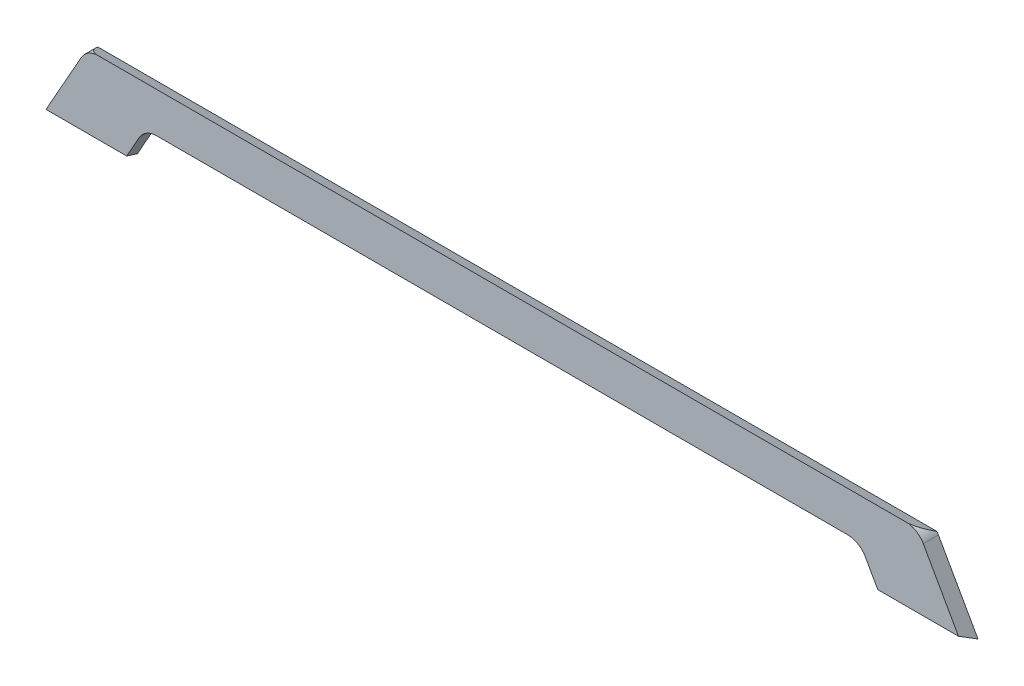
ISO-10303-21;
HEADER;
FILE_DESCRIPTION(('STEP AP214'),'2;1');
FILE_NAME('part.step','',(''),(''),'','','');
FILE_SCHEMA(('AUTOMOTIVE_DESIGN { 1 0 10303 214 1 1 1 1 }'));
ENDSEC;
DATA;
#1=APPLICATION_CONTEXT('core data for automotive mechanical design processes');
#2=APPLICATION_PROTOCOL_DEFINITION('international standard','automotive_design',2000,#1);
#3=PRODUCT_CONTEXT('',#1,'mechanical');
#4=PRODUCT('Part','Part','',(#3));
#5=PRODUCT_RELATED_PRODUCT_CATEGORY('part','',(#4));
#6=PRODUCT_DEFINITION_FORMATION('','',#4);
#7=PRODUCT_DEFINITION_CONTEXT('part definition',#1,'design');
#8=PRODUCT_DEFINITION('design','',#6,#7);
#9=PRODUCT_DEFINITION_SHAPE('','',#8);
#10=(LENGTH_UNIT() NAMED_UNIT(*) SI_UNIT(.MILLI.,.METRE.));
#11=(NAMED_UNIT(*) PLANE_ANGLE_UNIT() SI_UNIT($,.RADIAN.));
#12=(NAMED_UNIT(*) SI_UNIT($,.STERADIAN.) SOLID_ANGLE_UNIT());
#13=UNCERTAINTY_MEASURE_WITH_UNIT(LENGTH_MEASURE(1.E-05),#10,'distance_accuracy_value','');
#14=(GEOMETRIC_REPRESENTATION_CONTEXT(3) GLOBAL_UNCERTAINTY_ASSIGNED_CONTEXT((#13)) GLOBAL_UNIT_ASSIGNED_CONTEXT((#10,
#11,#12)) REPRESENTATION_CONTEXT('',''));
#15=CARTESIAN_POINT('',(0.,0.,0.));
#16=DIRECTION('',(0.,0.,1.));
#17=DIRECTION('',(1.,0.,0.));
#18=AXIS2_PLACEMENT_3D('',#15,#16,#17);
#19=CARTESIAN_POINT('',(478.375314030278,-101.474136013779,19.05));
#20=DIRECTION('',(0.871403098854543,0.490567670466268,0.));
#21=DIRECTION('',(-0.490567670466268,0.871403098854543,0.));
#22=AXIS2_PLACEMENT_3D('',#19,#20,#21);
#23=PLANE('',#22);
#24=DIRECTION('',(0.24917527172985,-0.442613969520122,-0.861396864368565));
#25=VECTOR('',#24,1.);
#26=CARTESIAN_POINT('',(474.286444933211,-94.2110132755685,14.1351868288331));
#27=LINE('',#26,#25);
#28=CARTESIAN_POINT('',(472.864742628403,-91.6856210236075,19.05));
#29=VERTEX_POINT('',#28);
#30=CARTESIAN_POINT('',(478.375314030278,-101.474136013779,0.));
#31=VERTEX_POINT('',#30);
#32=EDGE_CURVE('E151',#29,#31,#27,.T.);
#33=ORIENTED_EDGE('',*,*,#32,.F.);
#34=DIRECTION('',(0.490567670466267,-0.871403098854542,0.));
#35=VECTOR('',#34,1.);
#36=CARTESIAN_POINT('',(478.375314030278,-101.474136013779,19.05));
#37=LINE('',#36,#35);
#38=CARTESIAN_POINT('',(457.132157229424,-63.739581170157,19.05));
#39=VERTEX_POINT('',#38);
#40=EDGE_CURVE('E123',#39,#29,#37,.T.);
#41=ORIENTED_EDGE('',*,*,#40,.F.);
#42=DIRECTION('',(0.,0.,-1.));
#43=VECTOR('',#42,1.);
#44=CARTESIAN_POINT('',(457.132157229424,-63.739581170157,19.05));
#45=LINE('',#44,#43);
#46=CARTESIAN_POINT('',(457.132157229424,-63.739581170157,0.));
#47=VERTEX_POINT('',#46);
#48=EDGE_CURVE('E133',#39,#47,#45,.T.);
#49=ORIENTED_EDGE('',*,*,#48,.T.);
#50=DIRECTION('',(0.490567670466267,-0.871403098854542,0.));
#51=VECTOR('',#50,1.);
#52=CARTESIAN_POINT('',(478.375314030278,-101.474136013779,0.));
#53=LINE('',#52,#51);
#54=EDGE_CURVE('E155',#47,#31,#53,.T.);
#55=ORIENTED_EDGE('',*,*,#54,.T.);
#56=EDGE_LOOP('',(#33,#41,#49,#55));
#57=FACE_BOUND('',#56,.T.);
#58=ADVANCED_FACE('F33',(#57),#23,.F.);
#59=CARTESIAN_POINT('',(530.133638710906,-12.939581170157,19.05));
#60=DIRECTION('',(-0.871403098854546,-0.490567670466261,0.));
#61=DIRECTION('',(0.490567670466261,-0.871403098854546,0.));
#62=AXIS2_PLACEMENT_3D('',#59,#60,#61);
#63=PLANE('',#62);
#64=DIRECTION('',(-0.249175271729846,0.442613969520122,0.861396864368566));
#65=VECTOR('',#64,1.);
#66=CARTESIAN_POINT('',(563.027519876378,-71.369501661457,58.5883849580427));
#67=LINE('',#66,#65);
#68=CARTESIAN_POINT('',(579.975314030278,-101.474136013779,0.));
#69=VERTEX_POINT('',#68);
#70=CARTESIAN_POINT('',(574.464742628403,-91.6856210236075,19.05));
#71=VERTEX_POINT('',#70);
#72=EDGE_CURVE('E207',#69,#71,#67,.T.);
#73=ORIENTED_EDGE('',*,*,#72,.F.);
#74=DIRECTION('',(-0.490567670466261,0.871403098854546,0.));
#75=VECTOR('',#74,1.);
#76=CARTESIAN_POINT('',(530.133638710906,-12.939581170157,0.));
#77=LINE('',#76,#75);
#78=CARTESIAN_POINT('',(530.133638710906,-12.939581170157,0.));
#79=VERTEX_POINT('',#78);
#80=EDGE_CURVE('E129',#69,#79,#77,.T.);
#81=ORIENTED_EDGE('',*,*,#80,.T.);
#82=DIRECTION('',(0.,0.,-1.));
#83=VECTOR('',#82,1.);
#84=CARTESIAN_POINT('',(530.133638710906,-12.939581170157,19.05));
#85=LINE('',#84,#83);
#86=CARTESIAN_POINT('',(530.133638710906,-12.939581170157,19.05));
#87=VERTEX_POINT('',#86);
#88=EDGE_CURVE('E126',#87,#79,#85,.T.);
#89=ORIENTED_EDGE('',*,*,#88,.F.);
#90=DIRECTION('',(-0.490567670466261,0.871403098854546,0.));
#91=VECTOR('',#90,1.);
#92=CARTESIAN_POINT('',(530.133638710906,-12.939581170157,19.05));
#93=LINE('',#92,#91);
#94=EDGE_CURVE('E110',#71,#87,#93,.T.);
#95=ORIENTED_EDGE('',*,*,#94,.F.);
#96=EDGE_LOOP('',(#73,#81,#89,#95));
#97=FACE_BOUND('',#96,.T.);
#98=ADVANCED_FACE('F127',(#97),#63,.F.);
#99=CARTESIAN_POINT('',(508.,-25.4000000000001,19.05));
#100=DIRECTION('',(0.,0.,-1.));
#101=DIRECTION('',(-1.,0.,0.));
#102=AXIS2_PLACEMENT_3D('',#99,#100,#101);
#103=CYLINDRICAL_SURFACE('',#102,25.4000000000001);
#104=CARTESIAN_POINT('',(508.,-25.4000000000001,-29.9862459628207));
#105=DIRECTION('',(0.,0.889451585241872,-0.457029405520827));
#106=DIRECTION('',(0.,-0.457029405520827,-0.889451585241872));
#107=AXIS2_PLACEMENT_3D('',#104,#105,#106);
#108=ELLIPSE('',#107,55.5762926699529,25.4000000000001);
#109=CARTESIAN_POINT('',(511.209332786215,-0.2035680488819,19.05));
#110=VERTEX_POINT('',#109);
#111=CARTESIAN_POINT('',(528.192971423854,-9.99208303905329,0.));
#112=VERTEX_POINT('',#111);
#113=EDGE_CURVE('E48',#110,#112,#108,.T.);
#114=ORIENTED_EDGE('',*,*,#113,.F.);
#115=CARTESIAN_POINT('',(508.,-25.4000000000001,19.05));
#116=DIRECTION('',(0.,0.,1.));
#117=DIRECTION('',(-1.,0.,0.));
#118=AXIS2_PLACEMENT_3D('',#115,#116,#117);
#119=CIRCLE('',#118,25.4000000000001);
#120=EDGE_CURVE('E116',#87,#110,#119,.T.);
#121=ORIENTED_EDGE('',*,*,#120,.F.);
#122=ORIENTED_EDGE('',*,*,#88,.T.);
#123=CARTESIAN_POINT('',(508.,-25.4000000000001,0.));
#124=DIRECTION('',(0.,0.,1.));
#125=DIRECTION('',(-1.,0.,0.));
#126=AXIS2_PLACEMENT_3D('',#123,#124,#125);
#127=CIRCLE('',#126,25.4000000000001);
#128=EDGE_CURVE('E162',#79,#112,#127,.T.);
#129=ORIENTED_EDGE('',*,*,#128,.T.);
#130=EDGE_LOOP('',(#114,#121,#122,#129));
#131=FACE_BOUND('',#130,.T.);
#132=ADVANCED_FACE('F136',(#131),#103,.T.);
#133=CARTESIAN_POINT('',(-508.,-25.4000000000001,19.05));
#134=DIRECTION('',(0.,0.,-1.));
#135=DIRECTION('',(-1.,0.,0.));
#136=AXIS2_PLACEMENT_3D('',#133,#134,#135);
#137=CYLINDRICAL_SURFACE('',#136,25.4000000000001);
#138=CARTESIAN_POINT('',(-508.,-25.4000000000001,-29.9862459628207));
#139=DIRECTION('',(0.,0.889451585241872,-0.457029405520827));
#140=DIRECTION('',(0.,-0.457029405520827,-0.889451585241872));
#141=AXIS2_PLACEMENT_3D('',#138,#139,#140);
#142=ELLIPSE('',#141,55.5762926699529,25.4000000000001);
#143=CARTESIAN_POINT('',(-528.192971423854,-9.99208303905329,0.));
#144=VERTEX_POINT('',#143);
#145=CARTESIAN_POINT('',(-511.209332786215,-0.2035680488819,19.05));
#146=VERTEX_POINT('',#145);
#147=EDGE_CURVE('E221',#144,#146,#142,.T.);
#148=ORIENTED_EDGE('',*,*,#147,.F.);
#149=CARTESIAN_POINT('',(-508.,-25.4000000000001,0.));
#150=DIRECTION('',(0.,0.,1.));
#151=DIRECTION('',(1.,0.,0.));
#152=AXIS2_PLACEMENT_3D('',#149,#150,#151);
#153=CIRCLE('',#152,25.4000000000001);
#154=CARTESIAN_POINT('',(-530.133638710906,-12.939581170157,0.));
#155=VERTEX_POINT('',#154);
#156=EDGE_CURVE('E164',#144,#155,#153,.T.);
#157=ORIENTED_EDGE('',*,*,#156,.T.);
#158=DIRECTION('',(0.,0.,-1.));
#159=VECTOR('',#158,1.);
#160=CARTESIAN_POINT('',(-530.133638710906,-12.939581170157,19.05));
#161=LINE('',#160,#159);
#162=CARTESIAN_POINT('',(-530.133638710906,-12.939581170157,19.05));
#163=VERTEX_POINT('',#162);
#164=EDGE_CURVE('E134',#163,#155,#161,.T.);
#165=ORIENTED_EDGE('',*,*,#164,.F.);
#166=CARTESIAN_POINT('',(-508.,-25.4000000000001,19.05));
#167=DIRECTION('',(0.,0.,1.));
#168=DIRECTION('',(1.,0.,0.));
#169=AXIS2_PLACEMENT_3D('',#166,#167,#168);
#170=CIRCLE('',#169,25.4000000000001);
#171=EDGE_CURVE('E137',#146,#163,#170,.T.);
#172=ORIENTED_EDGE('',*,*,#171,.F.);
#173=EDGE_LOOP('',(#148,#157,#165,#172));
#174=FACE_BOUND('',#173,.T.);
#175=ADVANCED_FACE('F231',(#174),#137,.T.);
#176=CARTESIAN_POINT('',(-530.133638710906,-12.939581170157,19.05));
#177=DIRECTION('',(0.871403098854546,-0.490567670466261,0.));
#178=DIRECTION('',(0.490567670466261,0.871403098854546,0.));
#179=AXIS2_PLACEMENT_3D('',#176,#177,#178);
#180=PLANE('',#179);
#181=DIRECTION('',(-0.249175271729846,-0.442613969520122,-0.861396864368566));
#182=VECTOR('',#181,1.);
#183=CARTESIAN_POINT('',(-563.027519876378,-71.369501661457,58.5883849580427));
#184=LINE('',#183,#182);
#185=CARTESIAN_POINT('',(-574.464742628403,-91.6856210236075,19.05));
#186=VERTEX_POINT('',#185);
#187=CARTESIAN_POINT('',(-579.975314030278,-101.474136013779,0.));
#188=VERTEX_POINT('',#187);
#189=EDGE_CURVE('E210',#186,#188,#184,.T.);
#190=ORIENTED_EDGE('',*,*,#189,.F.);
#191=DIRECTION('',(-0.490567670466261,-0.871403098854546,0.));
#192=VECTOR('',#191,1.);
#193=CARTESIAN_POINT('',(-530.133638710906,-12.939581170157,19.05));
#194=LINE('',#193,#192);
#195=EDGE_CURVE('E139',#163,#186,#194,.T.);
#196=ORIENTED_EDGE('',*,*,#195,.F.);
#197=ORIENTED_EDGE('',*,*,#164,.T.);
#198=DIRECTION('',(-0.490567670466261,-0.871403098854546,0.));
#199=VECTOR('',#198,1.);
#200=CARTESIAN_POINT('',(-530.133638710906,-12.939581170157,0.));
#201=LINE('',#200,#199);
#202=EDGE_CURVE('E166',#155,#188,#201,.T.);
#203=ORIENTED_EDGE('',*,*,#202,.T.);
#204=EDGE_LOOP('',(#190,#196,#197,#203));
#205=FACE_BOUND('',#204,.T.);
#206=ADVANCED_FACE('F236',(#205),#180,.F.);
#207=CARTESIAN_POINT('',(-478.375314030278,-101.474136013779,19.05));
#208=DIRECTION('',(-0.871403098854546,0.490567670466261,0.));
#209=DIRECTION('',(-0.490567670466261,-0.871403098854546,0.));
#210=AXIS2_PLACEMENT_3D('',#207,#208,#209);
#211=PLANE('',#210);
#212=DIRECTION('',(0.249175271729846,0.442613969520122,0.861396864368566));
#213=VECTOR('',#212,1.);
#214=CARTESIAN_POINT('',(-474.286444933211,-94.2110132755685,14.1351868288332));
#215=LINE('',#214,#213);
#216=CARTESIAN_POINT('',(-478.375314030278,-101.474136013779,0.));
#217=VERTEX_POINT('',#216);
#218=CARTESIAN_POINT('',(-472.864742628403,-91.6856210236075,19.05));
#219=VERTEX_POINT('',#218);
#220=EDGE_CURVE('E212',#217,#219,#215,.T.);
#221=ORIENTED_EDGE('',*,*,#220,.F.);
#222=DIRECTION('',(0.490567670466261,0.871403098854546,0.));
#223=VECTOR('',#222,1.);
#224=CARTESIAN_POINT('',(-478.375314030278,-101.474136013779,0.));
#225=LINE('',#224,#223);
#226=CARTESIAN_POINT('',(-457.132157229424,-63.7395811701569,0.));
#227=VERTEX_POINT('',#226);
#228=EDGE_CURVE('E90',#217,#227,#225,.T.);
#229=ORIENTED_EDGE('',*,*,#228,.T.);
#230=DIRECTION('',(0.,0.,-1.));
#231=VECTOR('',#230,1.);
#232=CARTESIAN_POINT('',(-457.132157229424,-63.7395811701569,19.05));
#233=LINE('',#232,#231);
#234=CARTESIAN_POINT('',(-457.132157229424,-63.7395811701569,19.05));
#235=VERTEX_POINT('',#234);
#236=EDGE_CURVE('E146',#235,#227,#233,.T.);
#237=ORIENTED_EDGE('',*,*,#236,.F.);
#238=DIRECTION('',(0.490567670466261,0.871403098854546,0.));
#239=VECTOR('',#238,1.);
#240=CARTESIAN_POINT('',(-478.375314030278,-101.474136013779,19.05));
#241=LINE('',#240,#239);
#242=EDGE_CURVE('E56',#219,#235,#241,.T.);
#243=ORIENTED_EDGE('',*,*,#242,.F.);
#244=EDGE_LOOP('',(#221,#229,#237,#243));
#245=FACE_BOUND('',#244,.T.);
#246=ADVANCED_FACE('F250',(#245),#211,.F.);
#247=CARTESIAN_POINT('',(-434.998518518518,-76.2,19.05));
#248=DIRECTION('',(0.,0.,-1.));
#249=DIRECTION('',(-1.,0.,0.));
#250=AXIS2_PLACEMENT_3D('',#247,#248,#249);
#251=PLANE('',#250);
#252=DIRECTION('',(-1.,0.,0.));
#253=VECTOR('',#252,1.);
#254=CARTESIAN_POINT('',(-434.998518518518,-91.6856210236075,19.05));
#255=LINE('',#254,#253);
#256=EDGE_CURVE('E120',#71,#29,#255,.T.);
#257=ORIENTED_EDGE('',*,*,#256,.F.);
#258=ORIENTED_EDGE('',*,*,#94,.T.);
#259=ORIENTED_EDGE('',*,*,#120,.T.);
#260=DIRECTION('',(1.,0.,0.));
#261=VECTOR('',#260,1.);
#262=CARTESIAN_POINT('',(-434.998518518518,-0.2035680488819,19.05));
#263=LINE('',#262,#261);
#264=EDGE_CURVE('E218',#146,#110,#263,.T.);
#265=ORIENTED_EDGE('',*,*,#264,.F.);
#266=ORIENTED_EDGE('',*,*,#171,.T.);
#267=ORIENTED_EDGE('',*,*,#195,.T.);
#268=EDGE_CURVE('E215',#219,#186,#255,.T.);
#269=ORIENTED_EDGE('',*,*,#268,.F.);
#270=ORIENTED_EDGE('',*,*,#242,.T.);
#271=CARTESIAN_POINT('',(-434.998518518518,-76.2,19.05));
#272=DIRECTION('',(0.,0.,-1.));
#273=DIRECTION('',(-1.,0.,0.));
#274=AXIS2_PLACEMENT_3D('',#271,#272,#273);
#275=CIRCLE('',#274,25.4000000000001);
#276=CARTESIAN_POINT('',(-434.998518518518,-50.7999999999999,19.05));
#277=VERTEX_POINT('',#276);
#278=EDGE_CURVE('E173',#235,#277,#275,.T.);
#279=ORIENTED_EDGE('',*,*,#278,.T.);
#280=DIRECTION('',(1.,0.,0.));
#281=VECTOR('',#280,1.);
#282=CARTESIAN_POINT('',(-434.998518518518,-50.7999999999999,19.05));
#283=LINE('',#282,#281);
#284=CARTESIAN_POINT('',(434.998518518518,-50.8000000000002,19.05));
#285=VERTEX_POINT('',#284);
#286=EDGE_CURVE('E99',#277,#285,#283,.T.);
#287=ORIENTED_EDGE('',*,*,#286,.T.);
#288=CARTESIAN_POINT('',(434.998518518518,-76.2,19.05));
#289=DIRECTION('',(0.,0.,-1.));
#290=DIRECTION('',(1.,0.,0.));
#291=AXIS2_PLACEMENT_3D('',#288,#289,#290);
#292=CIRCLE('',#291,25.3999999999999);
#293=EDGE_CURVE('E201',#285,#39,#292,.T.);
#294=ORIENTED_EDGE('',*,*,#293,.T.);
#295=ORIENTED_EDGE('',*,*,#40,.T.);
#296=EDGE_LOOP('',(#257,#258,#259,#265,#266,#267,#269,#270,#279,#287,#294,#295));
#297=FACE_BOUND('',#296,.T.);
#298=ADVANCED_FACE('F112',(#297),#251,.F.);
#299=CARTESIAN_POINT('',(-434.998518518518,-76.2,0.));
#300=DIRECTION('',(0.,0.,-1.));
#301=DIRECTION('',(-1.,0.,0.));
#302=AXIS2_PLACEMENT_3D('',#299,#300,#301);
#303=PLANE('',#302);
#304=ORIENTED_EDGE('',*,*,#156,.F.);
#305=DIRECTION('',(1.,0.,0.));
#306=VECTOR('',#305,1.);
#307=CARTESIAN_POINT('',(-434.998518518518,-9.99208303905329,0.));
#308=LINE('',#307,#306);
#309=EDGE_CURVE('E11',#144,#112,#308,.T.);
#310=ORIENTED_EDGE('',*,*,#309,.T.);
#311=ORIENTED_EDGE('',*,*,#128,.F.);
#312=ORIENTED_EDGE('',*,*,#80,.F.);
#313=DIRECTION('',(1.,0.,0.));
#314=VECTOR('',#313,1.);
#315=CARTESIAN_POINT('',(579.975314030278,-101.474136013779,0.));
#316=LINE('',#315,#314);
#317=EDGE_CURVE('E158',#31,#69,#316,.T.);
#318=ORIENTED_EDGE('',*,*,#317,.F.);
#319=ORIENTED_EDGE('',*,*,#54,.F.);
#320=CARTESIAN_POINT('',(434.998518518518,-76.2,0.));
#321=DIRECTION('',(0.,0.,-1.));
#322=DIRECTION('',(1.,0.,0.));
#323=AXIS2_PLACEMENT_3D('',#320,#321,#322);
#324=CIRCLE('',#323,25.3999999999999);
#325=CARTESIAN_POINT('',(434.998518518518,-50.8000000000002,0.));
#326=VERTEX_POINT('',#325);
#327=EDGE_CURVE('E153',#326,#47,#324,.T.);
#328=ORIENTED_EDGE('',*,*,#327,.F.);
#329=DIRECTION('',(1.,0.,0.));
#330=VECTOR('',#329,1.);
#331=CARTESIAN_POINT('',(-434.998518518518,-50.7999999999999,0.));
#332=LINE('',#331,#330);
#333=CARTESIAN_POINT('',(-434.998518518518,-50.7999999999999,0.));
#334=VERTEX_POINT('',#333);
#335=EDGE_CURVE('E150',#334,#326,#332,.T.);
#336=ORIENTED_EDGE('',*,*,#335,.F.);
#337=CARTESIAN_POINT('',(-434.998518518518,-76.2,0.));
#338=DIRECTION('',(0.,0.,-1.));
#339=DIRECTION('',(-1.,0.,0.));
#340=AXIS2_PLACEMENT_3D('',#337,#338,#339);
#341=CIRCLE('',#340,25.4000000000001);
#342=EDGE_CURVE('E147',#227,#334,#341,.T.);
#343=ORIENTED_EDGE('',*,*,#342,.F.);
#344=ORIENTED_EDGE('',*,*,#228,.F.);
#345=DIRECTION('',(1.,0.,0.));
#346=VECTOR('',#345,1.);
#347=CARTESIAN_POINT('',(-579.975314030278,-101.474136013779,0.));
#348=LINE('',#347,#346);
#349=EDGE_CURVE('E169',#188,#217,#348,.T.);
#350=ORIENTED_EDGE('',*,*,#349,.F.);
#351=ORIENTED_EDGE('',*,*,#202,.F.);
#352=EDGE_LOOP('',(#304,#310,#311,#312,#318,#319,#328,#336,#343,#344,#350,#351));
#353=FACE_BOUND('',#352,.T.);
#354=ADVANCED_FACE('F188',(#353),#303,.T.);
#355=CARTESIAN_POINT('',(-434.998518518518,-76.2,19.05));
#356=DIRECTION('',(0.,0.,-1.));
#357=DIRECTION('',(-1.,0.,0.));
#358=AXIS2_PLACEMENT_3D('',#355,#356,#357);
#359=CYLINDRICAL_SURFACE('',#358,25.4000000000001);
#360=ORIENTED_EDGE('',*,*,#342,.T.);
#361=DIRECTION('',(0.,0.,-1.));
#362=VECTOR('',#361,1.);
#363=CARTESIAN_POINT('',(-434.998518518518,-50.7999999999999,19.05));
#364=LINE('',#363,#362);
#365=EDGE_CURVE('E41',#277,#334,#364,.T.);
#366=ORIENTED_EDGE('',*,*,#365,.F.);
#367=ORIENTED_EDGE('',*,*,#278,.F.);
#368=ORIENTED_EDGE('',*,*,#236,.T.);
#369=EDGE_LOOP('',(#360,#366,#367,#368));
#370=FACE_BOUND('',#369,.T.);
#371=ADVANCED_FACE('F35',(#370),#359,.F.);
#372=CARTESIAN_POINT('',(-434.998518518518,-50.7999999999999,19.05));
#373=DIRECTION('',(0.,1.,0.));
#374=DIRECTION('',(-1.,0.,0.));
#375=AXIS2_PLACEMENT_3D('',#372,#373,#374);
#376=PLANE('',#375);
#377=ORIENTED_EDGE('',*,*,#335,.T.);
#378=DIRECTION('',(0.,0.,-1.));
#379=VECTOR('',#378,1.);
#380=CARTESIAN_POINT('',(434.998518518518,-50.8000000000002,19.05));
#381=LINE('',#380,#379);
#382=EDGE_CURVE('E179',#285,#326,#381,.T.);
#383=ORIENTED_EDGE('',*,*,#382,.F.);
#384=ORIENTED_EDGE('',*,*,#286,.F.);
#385=ORIENTED_EDGE('',*,*,#365,.T.);
#386=EDGE_LOOP('',(#377,#383,#384,#385));
#387=FACE_BOUND('',#386,.T.);
#388=ADVANCED_FACE('F182',(#387),#376,.F.);
#389=CARTESIAN_POINT('',(434.998518518518,-76.2,19.05));
#390=DIRECTION('',(0.,0.,-1.));
#391=DIRECTION('',(-1.,0.,0.));
#392=AXIS2_PLACEMENT_3D('',#389,#390,#391);
#393=CYLINDRICAL_SURFACE('',#392,25.3999999999999);
#394=ORIENTED_EDGE('',*,*,#327,.T.);
#395=ORIENTED_EDGE('',*,*,#48,.F.);
#396=ORIENTED_EDGE('',*,*,#293,.F.);
#397=ORIENTED_EDGE('',*,*,#382,.T.);
#398=EDGE_LOOP('',(#394,#395,#396,#397));
#399=FACE_BOUND('',#398,.T.);
#400=ADVANCED_FACE('F196',(#399),#393,.F.);
#401=CARTESIAN_POINT('',(-579.975314030278,-29.1004771306313,-37.187960360695));
#402=DIRECTION('',(0.,0.889451585241872,-0.457029405520827));
#403=DIRECTION('',(0.,0.457029405520827,0.889451585241872));
#404=AXIS2_PLACEMENT_3D('',#401,#402,#403);
#405=PLANE('',#404);
#406=ORIENTED_EDGE('',*,*,#264,.T.);
#407=ORIENTED_EDGE('',*,*,#113,.T.);
#408=ORIENTED_EDGE('',*,*,#309,.F.);
#409=ORIENTED_EDGE('',*,*,#147,.T.);
#410=EDGE_LOOP('',(#406,#407,#408,#409));
#411=FACE_BOUND('',#410,.T.);
#412=ADVANCED_FACE('F225',(#411),#405,.T.);
#413=CARTESIAN_POINT('',(-579.975314030278,-101.474136013779,0.));
#414=DIRECTION('',(0.,-0.889451585241872,0.457029405520827));
#415=DIRECTION('',(0.,-0.457029405520827,-0.889451585241872));
#416=AXIS2_PLACEMENT_3D('',#413,#414,#415);
#417=PLANE('',#416);
#418=ORIENTED_EDGE('',*,*,#189,.T.);
#419=ORIENTED_EDGE('',*,*,#349,.T.);
#420=ORIENTED_EDGE('',*,*,#220,.T.);
#421=ORIENTED_EDGE('',*,*,#268,.T.);
#422=EDGE_LOOP('',(#418,#419,#420,#421));
#423=FACE_BOUND('',#422,.T.);
#424=ADVANCED_FACE('F249',(#423),#417,.T.);
#425=ORIENTED_EDGE('',*,*,#32,.T.);
#426=ORIENTED_EDGE('',*,*,#317,.T.);
#427=ORIENTED_EDGE('',*,*,#72,.T.);
#428=ORIENTED_EDGE('',*,*,#256,.T.);
#429=EDGE_LOOP('',(#425,#426,#427,#428));
#430=FACE_BOUND('',#429,.T.);
#431=ADVANCED_FACE('F248',(#430),#417,.T.);
#432=CLOSED_SHELL('',(#58,#98,#132,#175,#206,#246,#298,#354,#371,#388,#400,#412,#424,#431));
#433=MANIFOLD_SOLID_BREP('B2',#432);
#434=ADVANCED_BREP_SHAPE_REPRESENTATION('',(#18,#433),#14);
#435=SHAPE_DEFINITION_REPRESENTATION(#9,#434);
ENDSEC;
END-ISO-10303-21;
